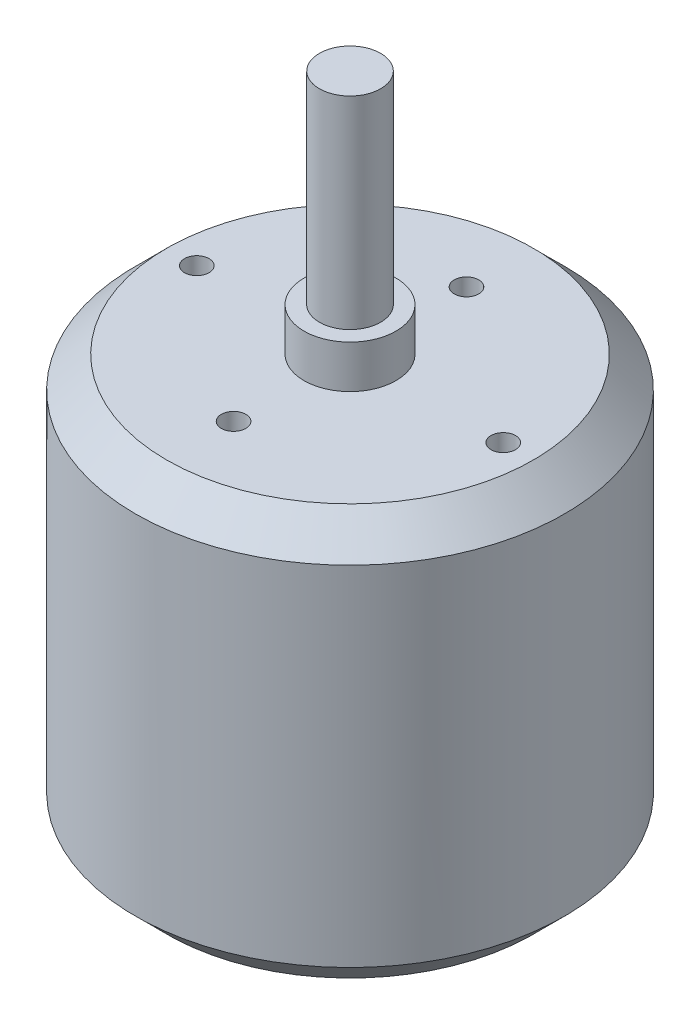
ISO-10303-21;
HEADER;
FILE_DESCRIPTION(('STEP AP214'),'2;1');
FILE_NAME('part.step','',(''),(''),'','','');
FILE_SCHEMA(('AUTOMOTIVE_DESIGN { 1 0 10303 214 1 1 1 1 }'));
ENDSEC;
DATA;
#1=APPLICATION_CONTEXT('core data for automotive mechanical design processes');
#2=APPLICATION_PROTOCOL_DEFINITION('international standard','automotive_design',2000,#1);
#3=PRODUCT_CONTEXT('',#1,'mechanical');
#4=PRODUCT('Part','Part','',(#3));
#5=PRODUCT_RELATED_PRODUCT_CATEGORY('part','',(#4));
#6=PRODUCT_DEFINITION_FORMATION('','',#4);
#7=PRODUCT_DEFINITION_CONTEXT('part definition',#1,'design');
#8=PRODUCT_DEFINITION('design','',#6,#7);
#9=PRODUCT_DEFINITION_SHAPE('','',#8);
#10=(LENGTH_UNIT() NAMED_UNIT(*) SI_UNIT(.MILLI.,.METRE.));
#11=(NAMED_UNIT(*) PLANE_ANGLE_UNIT() SI_UNIT($,.RADIAN.));
#12=(NAMED_UNIT(*) SI_UNIT($,.STERADIAN.) SOLID_ANGLE_UNIT());
#13=UNCERTAINTY_MEASURE_WITH_UNIT(LENGTH_MEASURE(1.E-05),#10,'distance_accuracy_value','');
#14=(GEOMETRIC_REPRESENTATION_CONTEXT(3) GLOBAL_UNCERTAINTY_ASSIGNED_CONTEXT((#13)) GLOBAL_UNIT_ASSIGNED_CONTEXT((#10,
#11,#12)) REPRESENTATION_CONTEXT('',''));
#15=CARTESIAN_POINT('',(0.,0.,0.));
#16=DIRECTION('',(0.,0.,1.));
#17=DIRECTION('',(1.,0.,0.));
#18=AXIS2_PLACEMENT_3D('',#15,#16,#17);
#19=CARTESIAN_POINT('',(0.,24.,0.));
#20=DIRECTION('',(0.,-1.,0.));
#21=DIRECTION('',(0.,0.,-1.));
#22=AXIS2_PLACEMENT_3D('',#19,#20,#21);
#23=CYLINDRICAL_SURFACE('',#22,17.5);
#24=CARTESIAN_POINT('',(0.,-6.95999999999998,0.));
#25=DIRECTION('',(0.,-1.,0.));
#26=DIRECTION('',(0.,0.,-1.));
#27=AXIS2_PLACEMENT_3D('',#24,#25,#26);
#28=CIRCLE('',#27,17.5);
#29=CARTESIAN_POINT('',(0.,-6.95999999999998,-17.5));
#30=VERTEX_POINT('',#29);
#31=EDGE_CURVE('E44',#30,#30,#28,.F.);
#32=ORIENTED_EDGE('',*,*,#31,.T.);
#33=EDGE_LOOP('',(#32));
#34=FACE_BOUND('',#33,.T.);
#35=CARTESIAN_POINT('',(0.,21.46,0.));
#36=DIRECTION('',(0.,1.,0.));
#37=DIRECTION('',(0.,0.,1.));
#38=AXIS2_PLACEMENT_3D('',#35,#36,#37);
#39=CIRCLE('',#38,17.5);
#40=CARTESIAN_POINT('',(0.,21.46,17.5));
#41=VERTEX_POINT('',#40);
#42=EDGE_CURVE('E79',#41,#41,#39,.F.);
#43=ORIENTED_EDGE('',*,*,#42,.T.);
#44=EDGE_LOOP('',(#43));
#45=FACE_BOUND('',#44,.T.);
#46=ADVANCED_FACE('F39',(#34,#45),#23,.T.);
#47=CARTESIAN_POINT('',(0.,24.,0.));
#48=DIRECTION('',(0.,1.,0.));
#49=DIRECTION('',(0.,0.,1.));
#50=AXIS2_PLACEMENT_3D('',#47,#48,#49);
#51=PLANE('',#50);
#52=CARTESIAN_POINT('',(0.,24.,-9.5));
#53=DIRECTION('',(0.,1.,0.));
#54=DIRECTION('',(0.,0.,1.));
#55=AXIS2_PLACEMENT_3D('',#52,#53,#54);
#56=CIRCLE('',#55,1.);
#57=CARTESIAN_POINT('',(0.,24.,-8.5));
#58=VERTEX_POINT('',#57);
#59=EDGE_CURVE('E186',#58,#58,#56,.T.);
#60=ORIENTED_EDGE('',*,*,#59,.F.);
#61=EDGE_LOOP('',(#60));
#62=FACE_BOUND('',#61,.T.);
#63=CARTESIAN_POINT('',(12.5,24.,0.));
#64=DIRECTION('',(0.,1.,0.));
#65=DIRECTION('',(0.,0.,1.));
#66=AXIS2_PLACEMENT_3D('',#63,#64,#65);
#67=CIRCLE('',#66,1.);
#68=CARTESIAN_POINT('',(12.5,24.,1.));
#69=VERTEX_POINT('',#68);
#70=EDGE_CURVE('E198',#69,#69,#67,.T.);
#71=ORIENTED_EDGE('',*,*,#70,.F.);
#72=EDGE_LOOP('',(#71));
#73=FACE_BOUND('',#72,.T.);
#74=CARTESIAN_POINT('',(0.,24.,9.5));
#75=DIRECTION('',(0.,1.,0.));
#76=DIRECTION('',(0.,0.,-1.));
#77=AXIS2_PLACEMENT_3D('',#74,#75,#76);
#78=CIRCLE('',#77,1.);
#79=CARTESIAN_POINT('',(0.,24.,8.5));
#80=VERTEX_POINT('',#79);
#81=EDGE_CURVE('E206',#80,#80,#78,.T.);
#82=ORIENTED_EDGE('',*,*,#81,.F.);
#83=EDGE_LOOP('',(#82));
#84=FACE_BOUND('',#83,.T.);
#85=CARTESIAN_POINT('',(-12.5,24.,0.));
#86=DIRECTION('',(0.,1.,0.));
#87=DIRECTION('',(0.,0.,-1.));
#88=AXIS2_PLACEMENT_3D('',#85,#86,#87);
#89=CIRCLE('',#88,1.);
#90=CARTESIAN_POINT('',(-12.5,24.,-1.));
#91=VERTEX_POINT('',#90);
#92=EDGE_CURVE('E213',#91,#91,#89,.T.);
#93=ORIENTED_EDGE('',*,*,#92,.F.);
#94=EDGE_LOOP('',(#93));
#95=FACE_BOUND('',#94,.T.);
#96=CARTESIAN_POINT('',(0.,24.,0.));
#97=DIRECTION('',(0.,1.,0.));
#98=DIRECTION('',(0.,0.,1.));
#99=AXIS2_PLACEMENT_3D('',#96,#97,#98);
#100=CIRCLE('',#99,14.96);
#101=CARTESIAN_POINT('',(0.,24.,14.96));
#102=VERTEX_POINT('',#101);
#103=EDGE_CURVE('E68',#102,#102,#100,.T.);
#104=ORIENTED_EDGE('',*,*,#103,.T.);
#105=EDGE_LOOP('',(#104));
#106=FACE_BOUND('',#105,.T.);
#107=CARTESIAN_POINT('',(0.,24.,0.));
#108=DIRECTION('',(0.,1.,0.));
#109=DIRECTION('',(0.,0.,1.));
#110=AXIS2_PLACEMENT_3D('',#107,#108,#109);
#111=CIRCLE('',#110,3.75);
#112=CARTESIAN_POINT('',(0.,24.,3.75));
#113=VERTEX_POINT('',#112);
#114=EDGE_CURVE('E69',#113,#113,#111,.T.);
#115=ORIENTED_EDGE('',*,*,#114,.F.);
#116=EDGE_LOOP('',(#115));
#117=FACE_BOUND('',#116,.T.);
#118=ADVANCED_FACE('F103',(#62,#73,#84,#95,#106,#117),#51,.T.);
#119=CARTESIAN_POINT('',(0.,27.5,0.));
#120=DIRECTION('',(0.,-1.,0.));
#121=DIRECTION('',(0.,0.,-1.));
#122=AXIS2_PLACEMENT_3D('',#119,#120,#121);
#123=CYLINDRICAL_SURFACE('',#122,3.75);
#124=CARTESIAN_POINT('',(0.,27.5,0.));
#125=DIRECTION('',(0.,1.,0.));
#126=DIRECTION('',(0.,0.,1.));
#127=AXIS2_PLACEMENT_3D('',#124,#125,#126);
#128=CIRCLE('',#127,3.75);
#129=CARTESIAN_POINT('',(0.,27.5,3.75));
#130=VERTEX_POINT('',#129);
#131=EDGE_CURVE('E63',#130,#130,#128,.T.);
#132=ORIENTED_EDGE('',*,*,#131,.F.);
#133=EDGE_LOOP('',(#132));
#134=FACE_BOUND('',#133,.T.);
#135=ORIENTED_EDGE('',*,*,#114,.T.);
#136=EDGE_LOOP('',(#135));
#137=FACE_BOUND('',#136,.T.);
#138=ADVANCED_FACE('F109',(#134,#137),#123,.T.);
#139=CARTESIAN_POINT('',(0.,27.5,0.));
#140=DIRECTION('',(0.,1.,0.));
#141=DIRECTION('',(0.,0.,1.));
#142=AXIS2_PLACEMENT_3D('',#139,#140,#141);
#143=PLANE('',#142);
#144=CARTESIAN_POINT('',(0.,27.5,0.));
#145=DIRECTION('',(0.,1.,0.));
#146=DIRECTION('',(0.,0.,1.));
#147=AXIS2_PLACEMENT_3D('',#144,#145,#146);
#148=CIRCLE('',#147,2.5);
#149=CARTESIAN_POINT('',(0.,27.5,2.5));
#150=VERTEX_POINT('',#149);
#151=EDGE_CURVE('E64',#150,#150,#148,.T.);
#152=ORIENTED_EDGE('',*,*,#151,.F.);
#153=EDGE_LOOP('',(#152));
#154=FACE_BOUND('',#153,.T.);
#155=ORIENTED_EDGE('',*,*,#131,.T.);
#156=EDGE_LOOP('',(#155));
#157=FACE_BOUND('',#156,.T.);
#158=ADVANCED_FACE('F134',(#154,#157),#143,.T.);
#159=CARTESIAN_POINT('',(0.,44.,0.));
#160=DIRECTION('',(0.,-1.,0.));
#161=DIRECTION('',(0.,0.,-1.));
#162=AXIS2_PLACEMENT_3D('',#159,#160,#161);
#163=CYLINDRICAL_SURFACE('',#162,2.5);
#164=CARTESIAN_POINT('',(0.,44.,0.));
#165=DIRECTION('',(0.,1.,0.));
#166=DIRECTION('',(0.,0.,1.));
#167=AXIS2_PLACEMENT_3D('',#164,#165,#166);
#168=CIRCLE('',#167,2.5);
#169=CARTESIAN_POINT('',(0.,44.,2.5));
#170=VERTEX_POINT('',#169);
#171=EDGE_CURVE('E59',#170,#170,#168,.T.);
#172=ORIENTED_EDGE('',*,*,#171,.F.);
#173=EDGE_LOOP('',(#172));
#174=FACE_BOUND('',#173,.T.);
#175=ORIENTED_EDGE('',*,*,#151,.T.);
#176=EDGE_LOOP('',(#175));
#177=FACE_BOUND('',#176,.T.);
#178=ADVANCED_FACE('F123',(#174,#177),#163,.T.);
#179=CARTESIAN_POINT('',(0.,44.,0.));
#180=DIRECTION('',(0.,1.,0.));
#181=DIRECTION('',(0.,0.,1.));
#182=AXIS2_PLACEMENT_3D('',#179,#180,#181);
#183=PLANE('',#182);
#184=ORIENTED_EDGE('',*,*,#171,.T.);
#185=EDGE_LOOP('',(#184));
#186=FACE_BOUND('',#185,.T.);
#187=ADVANCED_FACE('F118',(#186),#183,.T.);
#188=CARTESIAN_POINT('',(0.,24.,0.));
#189=DIRECTION('',(0.,-1.,0.));
#190=DIRECTION('',(0.,0.,-1.));
#191=AXIS2_PLACEMENT_3D('',#188,#189,#190);
#192=CONICAL_SURFACE('',#191,14.96,0.785398163397447);
#193=ORIENTED_EDGE('',*,*,#42,.F.);
#194=EDGE_LOOP('',(#193));
#195=FACE_BOUND('',#194,.T.);
#196=ORIENTED_EDGE('',*,*,#103,.F.);
#197=EDGE_LOOP('',(#196));
#198=FACE_BOUND('',#197,.T.);
#199=ADVANCED_FACE('F98',(#195,#198),#192,.T.);
#200=CARTESIAN_POINT('',(0.,-9.5,0.));
#201=DIRECTION('',(0.,-1.,0.));
#202=DIRECTION('',(0.,0.,-1.));
#203=AXIS2_PLACEMENT_3D('',#200,#201,#202);
#204=PLANE('',#203);
#205=CARTESIAN_POINT('',(0.,-9.5,0.));
#206=DIRECTION('',(0.,-1.,0.));
#207=DIRECTION('',(0.,0.,-1.));
#208=AXIS2_PLACEMENT_3D('',#205,#206,#207);
#209=CIRCLE('',#208,3.);
#210=CARTESIAN_POINT('',(0.,-9.5,-3.));
#211=VERTEX_POINT('',#210);
#212=EDGE_CURVE('E10',#211,#211,#209,.T.);
#213=ORIENTED_EDGE('',*,*,#212,.F.);
#214=EDGE_LOOP('',(#213));
#215=FACE_BOUND('',#214,.T.);
#216=CARTESIAN_POINT('',(0.,-9.5,0.));
#217=DIRECTION('',(0.,-1.,0.));
#218=DIRECTION('',(0.,0.,-1.));
#219=AXIS2_PLACEMENT_3D('',#216,#217,#218);
#220=CIRCLE('',#219,14.96);
#221=CARTESIAN_POINT('',(0.,-9.5,-14.96));
#222=VERTEX_POINT('',#221);
#223=EDGE_CURVE('E54',#222,#222,#220,.T.);
#224=ORIENTED_EDGE('',*,*,#223,.T.);
#225=EDGE_LOOP('',(#224));
#226=FACE_BOUND('',#225,.T.);
#227=ADVANCED_FACE('F86',(#215,#226),#204,.T.);
#228=CARTESIAN_POINT('',(0.,-9.5,0.));
#229=DIRECTION('',(0.,1.,0.));
#230=DIRECTION('',(0.,0.,1.));
#231=AXIS2_PLACEMENT_3D('',#228,#229,#230);
#232=CONICAL_SURFACE('',#231,14.96,0.785398163397444);
#233=ORIENTED_EDGE('',*,*,#31,.F.);
#234=EDGE_LOOP('',(#233));
#235=FACE_BOUND('',#234,.T.);
#236=ORIENTED_EDGE('',*,*,#223,.F.);
#237=EDGE_LOOP('',(#236));
#238=FACE_BOUND('',#237,.T.);
#239=ADVANCED_FACE('F42',(#235,#238),#232,.T.);
#240=CARTESIAN_POINT('',(0.,-10.5,0.));
#241=DIRECTION('',(0.,1.,0.));
#242=DIRECTION('',(0.,0.,1.));
#243=AXIS2_PLACEMENT_3D('',#240,#241,#242);
#244=CYLINDRICAL_SURFACE('',#243,3.);
#245=CARTESIAN_POINT('',(0.,-10.5,0.));
#246=DIRECTION('',(0.,-1.,0.));
#247=DIRECTION('',(0.,0.,-1.));
#248=AXIS2_PLACEMENT_3D('',#245,#246,#247);
#249=CIRCLE('',#248,3.);
#250=CARTESIAN_POINT('',(0.,-10.5,-3.));
#251=VERTEX_POINT('',#250);
#252=EDGE_CURVE('E57',#251,#251,#249,.T.);
#253=ORIENTED_EDGE('',*,*,#252,.F.);
#254=EDGE_LOOP('',(#253));
#255=FACE_BOUND('',#254,.T.);
#256=ORIENTED_EDGE('',*,*,#212,.T.);
#257=EDGE_LOOP('',(#256));
#258=FACE_BOUND('',#257,.T.);
#259=ADVANCED_FACE('F89',(#255,#258),#244,.T.);
#260=CARTESIAN_POINT('',(0.,-10.5,0.));
#261=DIRECTION('',(0.,-1.,0.));
#262=DIRECTION('',(0.,0.,-1.));
#263=AXIS2_PLACEMENT_3D('',#260,#261,#262);
#264=PLANE('',#263);
#265=ORIENTED_EDGE('',*,*,#252,.T.);
#266=EDGE_LOOP('',(#265));
#267=FACE_BOUND('',#266,.T.);
#268=ADVANCED_FACE('F95',(#267),#264,.T.);
#269=CARTESIAN_POINT('',(-12.5,-1.4,0.));
#270=DIRECTION('',(0.,1.,0.));
#271=DIRECTION('',(0.,0.,1.));
#272=AXIS2_PLACEMENT_3D('',#269,#270,#271);
#273=CYLINDRICAL_SURFACE('',#272,1.);
#274=CARTESIAN_POINT('',(-12.5,-1.4,0.));
#275=DIRECTION('',(0.,1.,0.));
#276=DIRECTION('',(0.,0.,-1.));
#277=AXIS2_PLACEMENT_3D('',#274,#275,#276);
#278=CIRCLE('',#277,1.);
#279=CARTESIAN_POINT('',(-12.5,-1.4,-1.));
#280=VERTEX_POINT('',#279);
#281=EDGE_CURVE('E210',#280,#280,#278,.T.);
#282=ORIENTED_EDGE('',*,*,#281,.F.);
#283=EDGE_LOOP('',(#282));
#284=FACE_BOUND('',#283,.T.);
#285=ORIENTED_EDGE('',*,*,#92,.T.);
#286=EDGE_LOOP('',(#285));
#287=FACE_BOUND('',#286,.T.);
#288=ADVANCED_FACE('F148',(#284,#287),#273,.F.);
#289=CARTESIAN_POINT('',(-12.5,-1.4,0.));
#290=DIRECTION('',(0.,-1.,0.));
#291=DIRECTION('',(0.,0.,-1.));
#292=AXIS2_PLACEMENT_3D('',#289,#290,#291);
#293=PLANE('',#292);
#294=ORIENTED_EDGE('',*,*,#281,.T.);
#295=EDGE_LOOP('',(#294));
#296=FACE_BOUND('',#295,.T.);
#297=ADVANCED_FACE('F152',(#296),#293,.F.);
#298=CARTESIAN_POINT('',(0.,-1.4,9.5));
#299=DIRECTION('',(0.,1.,0.));
#300=DIRECTION('',(0.,0.,1.));
#301=AXIS2_PLACEMENT_3D('',#298,#299,#300);
#302=CYLINDRICAL_SURFACE('',#301,1.);
#303=CARTESIAN_POINT('',(0.,-1.4,9.5));
#304=DIRECTION('',(0.,1.,0.));
#305=DIRECTION('',(0.,0.,-1.));
#306=AXIS2_PLACEMENT_3D('',#303,#304,#305);
#307=CIRCLE('',#306,1.);
#308=CARTESIAN_POINT('',(0.,-1.4,8.5));
#309=VERTEX_POINT('',#308);
#310=EDGE_CURVE('E202',#309,#309,#307,.T.);
#311=ORIENTED_EDGE('',*,*,#310,.F.);
#312=EDGE_LOOP('',(#311));
#313=FACE_BOUND('',#312,.T.);
#314=ORIENTED_EDGE('',*,*,#81,.T.);
#315=EDGE_LOOP('',(#314));
#316=FACE_BOUND('',#315,.T.);
#317=ADVANCED_FACE('F156',(#313,#316),#302,.F.);
#318=CARTESIAN_POINT('',(0.,-1.4,9.5));
#319=DIRECTION('',(0.,-1.,0.));
#320=DIRECTION('',(0.,0.,-1.));
#321=AXIS2_PLACEMENT_3D('',#318,#319,#320);
#322=PLANE('',#321);
#323=ORIENTED_EDGE('',*,*,#310,.T.);
#324=EDGE_LOOP('',(#323));
#325=FACE_BOUND('',#324,.T.);
#326=ADVANCED_FACE('F160',(#325),#322,.F.);
#327=CARTESIAN_POINT('',(12.5,-1.4,0.));
#328=DIRECTION('',(0.,1.,0.));
#329=DIRECTION('',(0.,0.,1.));
#330=AXIS2_PLACEMENT_3D('',#327,#328,#329);
#331=CYLINDRICAL_SURFACE('',#330,1.);
#332=CARTESIAN_POINT('',(12.5,-1.4,0.));
#333=DIRECTION('',(0.,1.,0.));
#334=DIRECTION('',(0.,0.,1.));
#335=AXIS2_PLACEMENT_3D('',#332,#333,#334);
#336=CIRCLE('',#335,1.);
#337=CARTESIAN_POINT('',(12.5,-1.4,1.));
#338=VERTEX_POINT('',#337);
#339=EDGE_CURVE('E192',#338,#338,#336,.T.);
#340=ORIENTED_EDGE('',*,*,#339,.F.);
#341=EDGE_LOOP('',(#340));
#342=FACE_BOUND('',#341,.T.);
#343=ORIENTED_EDGE('',*,*,#70,.T.);
#344=EDGE_LOOP('',(#343));
#345=FACE_BOUND('',#344,.T.);
#346=ADVANCED_FACE('F164',(#342,#345),#331,.F.);
#347=CARTESIAN_POINT('',(12.5,-1.4,0.));
#348=DIRECTION('',(0.,1.,0.));
#349=DIRECTION('',(0.,0.,1.));
#350=AXIS2_PLACEMENT_3D('',#347,#348,#349);
#351=PLANE('',#350);
#352=ORIENTED_EDGE('',*,*,#339,.T.);
#353=EDGE_LOOP('',(#352));
#354=FACE_BOUND('',#353,.T.);
#355=ADVANCED_FACE('F168',(#354),#351,.T.);
#356=CARTESIAN_POINT('',(0.,-1.4,-9.5));
#357=DIRECTION('',(0.,1.,0.));
#358=DIRECTION('',(0.,0.,1.));
#359=AXIS2_PLACEMENT_3D('',#356,#357,#358);
#360=CYLINDRICAL_SURFACE('',#359,1.);
#361=CARTESIAN_POINT('',(0.,-1.4,-9.5));
#362=DIRECTION('',(0.,1.,0.));
#363=DIRECTION('',(0.,0.,1.));
#364=AXIS2_PLACEMENT_3D('',#361,#362,#363);
#365=CIRCLE('',#364,1.);
#366=CARTESIAN_POINT('',(0.,-1.4,-8.5));
#367=VERTEX_POINT('',#366);
#368=EDGE_CURVE('E184',#367,#367,#365,.T.);
#369=ORIENTED_EDGE('',*,*,#368,.F.);
#370=EDGE_LOOP('',(#369));
#371=FACE_BOUND('',#370,.T.);
#372=ORIENTED_EDGE('',*,*,#59,.T.);
#373=EDGE_LOOP('',(#372));
#374=FACE_BOUND('',#373,.T.);
#375=ADVANCED_FACE('F172',(#371,#374),#360,.F.);
#376=CARTESIAN_POINT('',(0.,-1.4,-9.5));
#377=DIRECTION('',(0.,1.,0.));
#378=DIRECTION('',(0.,0.,1.));
#379=AXIS2_PLACEMENT_3D('',#376,#377,#378);
#380=PLANE('',#379);
#381=ORIENTED_EDGE('',*,*,#368,.T.);
#382=EDGE_LOOP('',(#381));
#383=FACE_BOUND('',#382,.T.);
#384=ADVANCED_FACE('F176',(#383),#380,.T.);
#385=CLOSED_SHELL('',(#46,#118,#138,#158,#178,#187,#199,#227,#239,#259,#268,#288,#297,#317,#326,
#346,#355,#375,#384));
#386=MANIFOLD_SOLID_BREP('B2',#385);
#387=ADVANCED_BREP_SHAPE_REPRESENTATION('',(#18,#386),#14);
#388=SHAPE_DEFINITION_REPRESENTATION(#9,#387);
ENDSEC;
END-ISO-10303-21;
